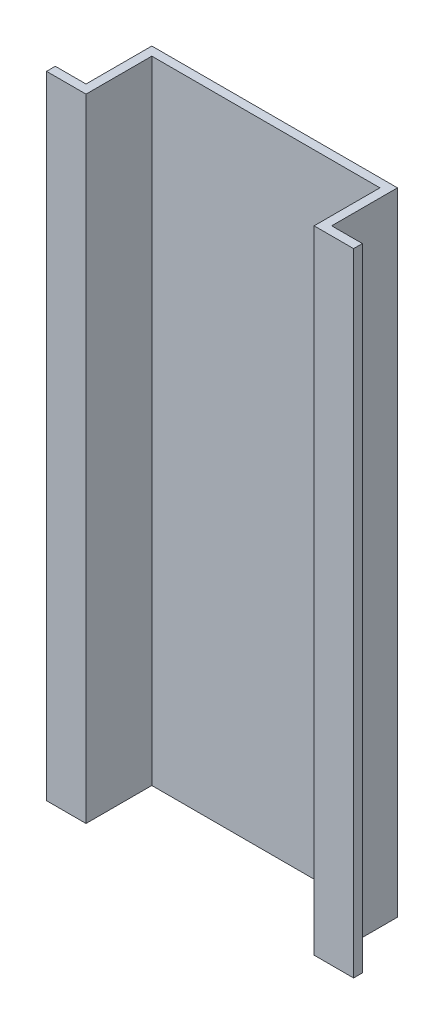
ISO-10303-21;
HEADER;
FILE_DESCRIPTION(('STEP AP214'),'2;1');
FILE_NAME('part.step','',(''),(''),'','','');
FILE_SCHEMA(('AUTOMOTIVE_DESIGN { 1 0 10303 214 1 1 1 1 }'));
ENDSEC;
DATA;
#1=APPLICATION_CONTEXT('core data for automotive mechanical design processes');
#2=APPLICATION_PROTOCOL_DEFINITION('international standard','automotive_design',2000,#1);
#3=PRODUCT_CONTEXT('',#1,'mechanical');
#4=PRODUCT('Part','Part','',(#3));
#5=PRODUCT_RELATED_PRODUCT_CATEGORY('part','',(#4));
#6=PRODUCT_DEFINITION_FORMATION('','',#4);
#7=PRODUCT_DEFINITION_CONTEXT('part definition',#1,'design');
#8=PRODUCT_DEFINITION('design','',#6,#7);
#9=PRODUCT_DEFINITION_SHAPE('','',#8);
#10=(LENGTH_UNIT() NAMED_UNIT(*) SI_UNIT(.MILLI.,.METRE.));
#11=(NAMED_UNIT(*) PLANE_ANGLE_UNIT() SI_UNIT($,.RADIAN.));
#12=(NAMED_UNIT(*) SI_UNIT($,.STERADIAN.) SOLID_ANGLE_UNIT());
#13=UNCERTAINTY_MEASURE_WITH_UNIT(LENGTH_MEASURE(1.E-05),#10,'distance_accuracy_value','');
#14=(GEOMETRIC_REPRESENTATION_CONTEXT(3) GLOBAL_UNCERTAINTY_ASSIGNED_CONTEXT((#13)) GLOBAL_UNIT_ASSIGNED_CONTEXT((#10,
#11,#12)) REPRESENTATION_CONTEXT('',''));
#15=CARTESIAN_POINT('',(0.,0.,0.));
#16=DIRECTION('',(0.,0.,1.));
#17=DIRECTION('',(1.,0.,0.));
#18=AXIS2_PLACEMENT_3D('',#15,#16,#17);
#19=CARTESIAN_POINT('',(0.,72.,0.5));
#20=DIRECTION('',(1.,0.,0.));
#21=DIRECTION('',(0.,0.,-1.));
#22=AXIS2_PLACEMENT_3D('',#19,#20,#21);
#23=PLANE('',#22);
#24=DIRECTION('',(0.,0.,1.));
#25=VECTOR('',#24,1.);
#26=CARTESIAN_POINT('',(0.,0.,0.5));
#27=LINE('',#26,#25);
#28=CARTESIAN_POINT('',(0.,0.,-0.5));
#29=VERTEX_POINT('',#28);
#30=CARTESIAN_POINT('',(0.,0.,0.5));
#31=VERTEX_POINT('',#30);
#32=EDGE_CURVE('E153',#29,#31,#27,.T.);
#33=ORIENTED_EDGE('',*,*,#32,.T.);
#34=DIRECTION('',(0.,-1.,0.));
#35=VECTOR('',#34,1.);
#36=CARTESIAN_POINT('',(0.,72.,0.5));
#37=LINE('',#36,#35);
#38=CARTESIAN_POINT('',(0.,72.,0.5));
#39=VERTEX_POINT('',#38);
#40=EDGE_CURVE('E11',#39,#31,#37,.T.);
#41=ORIENTED_EDGE('',*,*,#40,.F.);
#42=DIRECTION('',(0.,0.,1.));
#43=VECTOR('',#42,1.);
#44=CARTESIAN_POINT('',(0.,72.,0.5));
#45=LINE('',#44,#43);
#46=CARTESIAN_POINT('',(0.,72.,-0.5));
#47=VERTEX_POINT('',#46);
#48=EDGE_CURVE('E175',#47,#39,#45,.T.);
#49=ORIENTED_EDGE('',*,*,#48,.F.);
#50=DIRECTION('',(0.,-1.,0.));
#51=VECTOR('',#50,1.);
#52=CARTESIAN_POINT('',(0.,72.,-0.5));
#53=LINE('',#52,#51);
#54=EDGE_CURVE('E149',#47,#29,#53,.T.);
#55=ORIENTED_EDGE('',*,*,#54,.T.);
#56=EDGE_LOOP('',(#33,#41,#49,#55));
#57=FACE_BOUND('',#56,.T.);
#58=ADVANCED_FACE('F33',(#57),#23,.F.);
#59=CARTESIAN_POINT('',(0.,72.,0.5));
#60=DIRECTION('',(0.,0.,-1.));
#61=DIRECTION('',(-1.,0.,0.));
#62=AXIS2_PLACEMENT_3D('',#59,#60,#61);
#63=PLANE('',#62);
#64=DIRECTION('',(1.,0.,0.));
#65=VECTOR('',#64,1.);
#66=CARTESIAN_POINT('',(0.,0.,0.5));
#67=LINE('',#66,#65);
#68=CARTESIAN_POINT('',(4.5,0.,0.5));
#69=VERTEX_POINT('',#68);
#70=EDGE_CURVE('E156',#31,#69,#67,.T.);
#71=ORIENTED_EDGE('',*,*,#70,.T.);
#72=DIRECTION('',(0.,-1.,0.));
#73=VECTOR('',#72,1.);
#74=CARTESIAN_POINT('',(4.5,72.,0.5));
#75=LINE('',#74,#73);
#76=CARTESIAN_POINT('',(4.5,72.,0.5));
#77=VERTEX_POINT('',#76);
#78=EDGE_CURVE('E41',#77,#69,#75,.T.);
#79=ORIENTED_EDGE('',*,*,#78,.F.);
#80=DIRECTION('',(1.,0.,0.));
#81=VECTOR('',#80,1.);
#82=CARTESIAN_POINT('',(0.,72.,0.5));
#83=LINE('',#82,#81);
#84=EDGE_CURVE('E104',#39,#77,#83,.T.);
#85=ORIENTED_EDGE('',*,*,#84,.F.);
#86=ORIENTED_EDGE('',*,*,#40,.T.);
#87=EDGE_LOOP('',(#71,#79,#85,#86));
#88=FACE_BOUND('',#87,.T.);
#89=ADVANCED_FACE('F253',(#88),#63,.F.);
#90=CARTESIAN_POINT('',(4.5,72.,0.5));
#91=DIRECTION('',(-1.,0.,0.));
#92=DIRECTION('',(0.,0.,1.));
#93=AXIS2_PLACEMENT_3D('',#90,#91,#92);
#94=PLANE('',#93);
#95=DIRECTION('',(0.,0.,-1.));
#96=VECTOR('',#95,1.);
#97=CARTESIAN_POINT('',(4.5,0.,0.5));
#98=LINE('',#97,#96);
#99=CARTESIAN_POINT('',(4.5,0.,-7.));
#100=VERTEX_POINT('',#99);
#101=EDGE_CURVE('E158',#69,#100,#98,.T.);
#102=ORIENTED_EDGE('',*,*,#101,.T.);
#103=DIRECTION('',(0.,-1.,0.));
#104=VECTOR('',#103,1.);
#105=CARTESIAN_POINT('',(4.5,72.,-7.));
#106=LINE('',#105,#104);
#107=CARTESIAN_POINT('',(4.5,72.,-7.));
#108=VERTEX_POINT('',#107);
#109=EDGE_CURVE('E194',#108,#100,#106,.T.);
#110=ORIENTED_EDGE('',*,*,#109,.F.);
#111=DIRECTION('',(0.,0.,-1.));
#112=VECTOR('',#111,1.);
#113=CARTESIAN_POINT('',(4.5,72.,0.5));
#114=LINE('',#113,#112);
#115=EDGE_CURVE('E202',#77,#108,#114,.T.);
#116=ORIENTED_EDGE('',*,*,#115,.F.);
#117=ORIENTED_EDGE('',*,*,#78,.T.);
#118=EDGE_LOOP('',(#102,#110,#116,#117));
#119=FACE_BOUND('',#118,.T.);
#120=ADVANCED_FACE('F200',(#119),#94,.F.);
#121=CARTESIAN_POINT('',(4.5,72.,-7.));
#122=DIRECTION('',(0.,0.,-1.));
#123=DIRECTION('',(-1.,0.,0.));
#124=AXIS2_PLACEMENT_3D('',#121,#122,#123);
#125=PLANE('',#124);
#126=DIRECTION('',(1.,0.,0.));
#127=VECTOR('',#126,1.);
#128=CARTESIAN_POINT('',(4.5,0.,-7.));
#129=LINE('',#128,#127);
#130=CARTESIAN_POINT('',(30.5,0.,-7.));
#131=VERTEX_POINT('',#130);
#132=EDGE_CURVE('E160',#100,#131,#129,.T.);
#133=ORIENTED_EDGE('',*,*,#132,.T.);
#134=DIRECTION('',(0.,-1.,0.));
#135=VECTOR('',#134,1.);
#136=CARTESIAN_POINT('',(30.5,72.,-7.));
#137=LINE('',#136,#135);
#138=CARTESIAN_POINT('',(30.5,72.,-7.));
#139=VERTEX_POINT('',#138);
#140=EDGE_CURVE('E191',#139,#131,#137,.T.);
#141=ORIENTED_EDGE('',*,*,#140,.F.);
#142=DIRECTION('',(1.,0.,0.));
#143=VECTOR('',#142,1.);
#144=CARTESIAN_POINT('',(4.5,72.,-7.));
#145=LINE('',#144,#143);
#146=EDGE_CURVE('E220',#108,#139,#145,.T.);
#147=ORIENTED_EDGE('',*,*,#146,.F.);
#148=ORIENTED_EDGE('',*,*,#109,.T.);
#149=EDGE_LOOP('',(#133,#141,#147,#148));
#150=FACE_BOUND('',#149,.T.);
#151=ADVANCED_FACE('F211',(#150),#125,.F.);
#152=CARTESIAN_POINT('',(30.5,72.,-7.));
#153=DIRECTION('',(1.,0.,0.));
#154=DIRECTION('',(0.,0.,-1.));
#155=AXIS2_PLACEMENT_3D('',#152,#153,#154);
#156=PLANE('',#155);
#157=DIRECTION('',(0.,0.,1.));
#158=VECTOR('',#157,1.);
#159=CARTESIAN_POINT('',(30.5,0.,-7.));
#160=LINE('',#159,#158);
#161=CARTESIAN_POINT('',(30.5,0.,0.5));
#162=VERTEX_POINT('',#161);
#163=EDGE_CURVE('E162',#131,#162,#160,.T.);
#164=ORIENTED_EDGE('',*,*,#163,.T.);
#165=DIRECTION('',(0.,-1.,0.));
#166=VECTOR('',#165,1.);
#167=CARTESIAN_POINT('',(30.5,72.,0.5));
#168=LINE('',#167,#166);
#169=CARTESIAN_POINT('',(30.5,72.,0.5));
#170=VERTEX_POINT('',#169);
#171=EDGE_CURVE('E188',#170,#162,#168,.T.);
#172=ORIENTED_EDGE('',*,*,#171,.F.);
#173=DIRECTION('',(0.,0.,1.));
#174=VECTOR('',#173,1.);
#175=CARTESIAN_POINT('',(30.5,72.,-7.));
#176=LINE('',#175,#174);
#177=EDGE_CURVE('E217',#139,#170,#176,.T.);
#178=ORIENTED_EDGE('',*,*,#177,.F.);
#179=ORIENTED_EDGE('',*,*,#140,.T.);
#180=EDGE_LOOP('',(#164,#172,#178,#179));
#181=FACE_BOUND('',#180,.T.);
#182=ADVANCED_FACE('F215',(#181),#156,.F.);
#183=CARTESIAN_POINT('',(30.5,72.,0.5));
#184=DIRECTION('',(0.,0.,-1.));
#185=DIRECTION('',(-1.,0.,0.));
#186=AXIS2_PLACEMENT_3D('',#183,#184,#185);
#187=PLANE('',#186);
#188=DIRECTION('',(1.,0.,0.));
#189=VECTOR('',#188,1.);
#190=CARTESIAN_POINT('',(30.5,0.,0.5));
#191=LINE('',#190,#189);
#192=CARTESIAN_POINT('',(35.,0.,0.5));
#193=VERTEX_POINT('',#192);
#194=EDGE_CURVE('E164',#162,#193,#191,.T.);
#195=ORIENTED_EDGE('',*,*,#194,.T.);
#196=DIRECTION('',(0.,-1.,0.));
#197=VECTOR('',#196,1.);
#198=CARTESIAN_POINT('',(35.,72.,0.5));
#199=LINE('',#198,#197);
#200=CARTESIAN_POINT('',(35.,72.,0.5));
#201=VERTEX_POINT('',#200);
#202=EDGE_CURVE('E185',#201,#193,#199,.T.);
#203=ORIENTED_EDGE('',*,*,#202,.F.);
#204=DIRECTION('',(1.,0.,0.));
#205=VECTOR('',#204,1.);
#206=CARTESIAN_POINT('',(30.5,72.,0.5));
#207=LINE('',#206,#205);
#208=EDGE_CURVE('E219',#170,#201,#207,.T.);
#209=ORIENTED_EDGE('',*,*,#208,.F.);
#210=ORIENTED_EDGE('',*,*,#171,.T.);
#211=EDGE_LOOP('',(#195,#203,#209,#210));
#212=FACE_BOUND('',#211,.T.);
#213=ADVANCED_FACE('F266',(#212),#187,.F.);
#214=CARTESIAN_POINT('',(35.,72.,0.5));
#215=DIRECTION('',(-1.,0.,0.));
#216=DIRECTION('',(0.,0.,1.));
#217=AXIS2_PLACEMENT_3D('',#214,#215,#216);
#218=PLANE('',#217);
#219=DIRECTION('',(0.,0.,-1.));
#220=VECTOR('',#219,1.);
#221=CARTESIAN_POINT('',(35.,0.,0.5));
#222=LINE('',#221,#220);
#223=CARTESIAN_POINT('',(35.,0.,-0.5));
#224=VERTEX_POINT('',#223);
#225=EDGE_CURVE('E166',#193,#224,#222,.T.);
#226=ORIENTED_EDGE('',*,*,#225,.T.);
#227=DIRECTION('',(0.,-1.,0.));
#228=VECTOR('',#227,1.);
#229=CARTESIAN_POINT('',(35.,72.,-0.5));
#230=LINE('',#229,#228);
#231=CARTESIAN_POINT('',(35.,72.,-0.5));
#232=VERTEX_POINT('',#231);
#233=EDGE_CURVE('E182',#232,#224,#230,.T.);
#234=ORIENTED_EDGE('',*,*,#233,.F.);
#235=DIRECTION('',(0.,0.,-1.));
#236=VECTOR('',#235,1.);
#237=CARTESIAN_POINT('',(35.,72.,0.5));
#238=LINE('',#237,#236);
#239=EDGE_CURVE('E222',#201,#232,#238,.T.);
#240=ORIENTED_EDGE('',*,*,#239,.F.);
#241=ORIENTED_EDGE('',*,*,#202,.T.);
#242=EDGE_LOOP('',(#226,#234,#240,#241));
#243=FACE_BOUND('',#242,.T.);
#244=ADVANCED_FACE('F269',(#243),#218,.F.);
#245=CARTESIAN_POINT('',(31.5,72.,-0.5));
#246=DIRECTION('',(0.,0.,1.));
#247=DIRECTION('',(1.,0.,0.));
#248=AXIS2_PLACEMENT_3D('',#245,#246,#247);
#249=PLANE('',#248);
#250=DIRECTION('',(-1.,0.,0.));
#251=VECTOR('',#250,1.);
#252=CARTESIAN_POINT('',(31.5,0.,-0.5));
#253=LINE('',#252,#251);
#254=CARTESIAN_POINT('',(31.5,0.,-0.5));
#255=VERTEX_POINT('',#254);
#256=EDGE_CURVE('E168',#224,#255,#253,.T.);
#257=ORIENTED_EDGE('',*,*,#256,.T.);
#258=DIRECTION('',(0.,-1.,0.));
#259=VECTOR('',#258,1.);
#260=CARTESIAN_POINT('',(31.5,72.,-0.5));
#261=LINE('',#260,#259);
#262=CARTESIAN_POINT('',(31.5,72.,-0.5));
#263=VERTEX_POINT('',#262);
#264=EDGE_CURVE('E179',#263,#255,#261,.T.);
#265=ORIENTED_EDGE('',*,*,#264,.F.);
#266=DIRECTION('',(-1.,0.,0.));
#267=VECTOR('',#266,1.);
#268=CARTESIAN_POINT('',(31.5,72.,-0.5));
#269=LINE('',#268,#267);
#270=EDGE_CURVE('E228',#232,#263,#269,.T.);
#271=ORIENTED_EDGE('',*,*,#270,.F.);
#272=ORIENTED_EDGE('',*,*,#233,.T.);
#273=EDGE_LOOP('',(#257,#265,#271,#272));
#274=FACE_BOUND('',#273,.T.);
#275=ADVANCED_FACE('F234',(#274),#249,.F.);
#276=CARTESIAN_POINT('',(31.5,72.,-8.));
#277=DIRECTION('',(-1.,0.,0.));
#278=DIRECTION('',(0.,0.,1.));
#279=AXIS2_PLACEMENT_3D('',#276,#277,#278);
#280=PLANE('',#279);
#281=DIRECTION('',(0.,0.,-1.));
#282=VECTOR('',#281,1.);
#283=CARTESIAN_POINT('',(31.5,0.,-8.));
#284=LINE('',#283,#282);
#285=CARTESIAN_POINT('',(31.5,0.,-8.));
#286=VERTEX_POINT('',#285);
#287=EDGE_CURVE('E170',#255,#286,#284,.T.);
#288=ORIENTED_EDGE('',*,*,#287,.T.);
#289=DIRECTION('',(0.,-1.,0.));
#290=VECTOR('',#289,1.);
#291=CARTESIAN_POINT('',(31.5,72.,-8.));
#292=LINE('',#291,#290);
#293=CARTESIAN_POINT('',(31.5,72.,-8.));
#294=VERTEX_POINT('',#293);
#295=EDGE_CURVE('E144',#294,#286,#292,.T.);
#296=ORIENTED_EDGE('',*,*,#295,.F.);
#297=DIRECTION('',(0.,0.,-1.));
#298=VECTOR('',#297,1.);
#299=CARTESIAN_POINT('',(31.5,72.,-8.));
#300=LINE('',#299,#298);
#301=EDGE_CURVE('E135',#263,#294,#300,.T.);
#302=ORIENTED_EDGE('',*,*,#301,.F.);
#303=ORIENTED_EDGE('',*,*,#264,.T.);
#304=EDGE_LOOP('',(#288,#296,#302,#303));
#305=FACE_BOUND('',#304,.T.);
#306=ADVANCED_FACE('F238',(#305),#280,.F.);
#307=CARTESIAN_POINT('',(3.5,72.,-8.));
#308=DIRECTION('',(0.,0.,1.));
#309=DIRECTION('',(1.,0.,0.));
#310=AXIS2_PLACEMENT_3D('',#307,#308,#309);
#311=PLANE('',#310);
#312=DIRECTION('',(-1.,0.,0.));
#313=VECTOR('',#312,1.);
#314=CARTESIAN_POINT('',(3.5,0.,-8.));
#315=LINE('',#314,#313);
#316=CARTESIAN_POINT('',(3.5,0.,-8.));
#317=VERTEX_POINT('',#316);
#318=EDGE_CURVE('E143',#286,#317,#315,.T.);
#319=ORIENTED_EDGE('',*,*,#318,.T.);
#320=DIRECTION('',(0.,-1.,0.));
#321=VECTOR('',#320,1.);
#322=CARTESIAN_POINT('',(3.5,72.,-8.));
#323=LINE('',#322,#321);
#324=CARTESIAN_POINT('',(3.5,72.,-8.));
#325=VERTEX_POINT('',#324);
#326=EDGE_CURVE('E140',#325,#317,#323,.T.);
#327=ORIENTED_EDGE('',*,*,#326,.F.);
#328=DIRECTION('',(-1.,0.,0.));
#329=VECTOR('',#328,1.);
#330=CARTESIAN_POINT('',(3.5,72.,-8.));
#331=LINE('',#330,#329);
#332=EDGE_CURVE('E129',#294,#325,#331,.T.);
#333=ORIENTED_EDGE('',*,*,#332,.F.);
#334=ORIENTED_EDGE('',*,*,#295,.T.);
#335=EDGE_LOOP('',(#319,#327,#333,#334));
#336=FACE_BOUND('',#335,.T.);
#337=ADVANCED_FACE('F141',(#336),#311,.F.);
#338=CARTESIAN_POINT('',(3.5,72.,-0.5));
#339=DIRECTION('',(1.,0.,0.));
#340=DIRECTION('',(0.,0.,-1.));
#341=AXIS2_PLACEMENT_3D('',#338,#339,#340);
#342=PLANE('',#341);
#343=DIRECTION('',(0.,0.,1.));
#344=VECTOR('',#343,1.);
#345=CARTESIAN_POINT('',(3.5,0.,-0.5));
#346=LINE('',#345,#344);
#347=CARTESIAN_POINT('',(3.5,0.,-0.5));
#348=VERTEX_POINT('',#347);
#349=EDGE_CURVE('E90',#317,#348,#346,.T.);
#350=ORIENTED_EDGE('',*,*,#349,.T.);
#351=DIRECTION('',(0.,-1.,0.));
#352=VECTOR('',#351,1.);
#353=CARTESIAN_POINT('',(3.5,72.,-0.5));
#354=LINE('',#353,#352);
#355=CARTESIAN_POINT('',(3.5,72.,-0.5));
#356=VERTEX_POINT('',#355);
#357=EDGE_CURVE('E145',#356,#348,#354,.T.);
#358=ORIENTED_EDGE('',*,*,#357,.F.);
#359=DIRECTION('',(0.,0.,1.));
#360=VECTOR('',#359,1.);
#361=CARTESIAN_POINT('',(3.5,72.,-0.5));
#362=LINE('',#361,#360);
#363=EDGE_CURVE('E133',#325,#356,#362,.T.);
#364=ORIENTED_EDGE('',*,*,#363,.F.);
#365=ORIENTED_EDGE('',*,*,#326,.T.);
#366=EDGE_LOOP('',(#350,#358,#364,#365));
#367=FACE_BOUND('',#366,.T.);
#368=ADVANCED_FACE('F147',(#367),#342,.F.);
#369=CARTESIAN_POINT('',(0.,72.,-0.5));
#370=DIRECTION('',(0.,0.,1.));
#371=DIRECTION('',(1.,0.,0.));
#372=AXIS2_PLACEMENT_3D('',#369,#370,#371);
#373=PLANE('',#372);
#374=DIRECTION('',(-1.,0.,0.));
#375=VECTOR('',#374,1.);
#376=CARTESIAN_POINT('',(0.,0.,-0.5));
#377=LINE('',#376,#375);
#378=EDGE_CURVE('E96',#348,#29,#377,.T.);
#379=ORIENTED_EDGE('',*,*,#378,.T.);
#380=ORIENTED_EDGE('',*,*,#54,.F.);
#381=DIRECTION('',(-1.,0.,0.));
#382=VECTOR('',#381,1.);
#383=CARTESIAN_POINT('',(0.,72.,-0.5));
#384=LINE('',#383,#382);
#385=EDGE_CURVE('E49',#356,#47,#384,.T.);
#386=ORIENTED_EDGE('',*,*,#385,.F.);
#387=ORIENTED_EDGE('',*,*,#357,.T.);
#388=EDGE_LOOP('',(#379,#380,#386,#387));
#389=FACE_BOUND('',#388,.T.);
#390=ADVANCED_FACE('F242',(#389),#373,.F.);
#391=CARTESIAN_POINT('',(0.,72.,0.));
#392=DIRECTION('',(0.,-1.,0.));
#393=DIRECTION('',(0.,0.,-1.));
#394=AXIS2_PLACEMENT_3D('',#391,#392,#393);
#395=PLANE('',#394);
#396=ORIENTED_EDGE('',*,*,#48,.T.);
#397=ORIENTED_EDGE('',*,*,#84,.T.);
#398=ORIENTED_EDGE('',*,*,#115,.T.);
#399=ORIENTED_EDGE('',*,*,#146,.T.);
#400=ORIENTED_EDGE('',*,*,#177,.T.);
#401=ORIENTED_EDGE('',*,*,#208,.T.);
#402=ORIENTED_EDGE('',*,*,#239,.T.);
#403=ORIENTED_EDGE('',*,*,#270,.T.);
#404=ORIENTED_EDGE('',*,*,#301,.T.);
#405=ORIENTED_EDGE('',*,*,#332,.T.);
#406=ORIENTED_EDGE('',*,*,#363,.T.);
#407=ORIENTED_EDGE('',*,*,#385,.T.);
#408=EDGE_LOOP('',(#396,#397,#398,#399,#400,#401,#402,#403,#404,#405,#406,#407));
#409=FACE_BOUND('',#408,.T.);
#410=ADVANCED_FACE('F131',(#409),#395,.F.);
#411=CARTESIAN_POINT('',(0.,0.,0.));
#412=DIRECTION('',(0.,-1.,0.));
#413=DIRECTION('',(0.,0.,-1.));
#414=AXIS2_PLACEMENT_3D('',#411,#412,#413);
#415=PLANE('',#414);
#416=ORIENTED_EDGE('',*,*,#32,.F.);
#417=ORIENTED_EDGE('',*,*,#378,.F.);
#418=ORIENTED_EDGE('',*,*,#349,.F.);
#419=ORIENTED_EDGE('',*,*,#318,.F.);
#420=ORIENTED_EDGE('',*,*,#287,.F.);
#421=ORIENTED_EDGE('',*,*,#256,.F.);
#422=ORIENTED_EDGE('',*,*,#225,.F.);
#423=ORIENTED_EDGE('',*,*,#194,.F.);
#424=ORIENTED_EDGE('',*,*,#163,.F.);
#425=ORIENTED_EDGE('',*,*,#132,.F.);
#426=ORIENTED_EDGE('',*,*,#101,.F.);
#427=ORIENTED_EDGE('',*,*,#70,.F.);
#428=EDGE_LOOP('',(#416,#417,#418,#419,#420,#421,#422,#423,#424,#425,#426,#427));
#429=FACE_BOUND('',#428,.T.);
#430=ADVANCED_FACE('F206',(#429),#415,.T.);
#431=CLOSED_SHELL('',(#58,#89,#120,#151,#182,#213,#244,#275,#306,#337,#368,#390,#410,#430));
#432=MANIFOLD_SOLID_BREP('B2',#431);
#433=ADVANCED_BREP_SHAPE_REPRESENTATION('',(#18,#432),#14);
#434=SHAPE_DEFINITION_REPRESENTATION(#9,#433);
ENDSEC;
END-ISO-10303-21;
